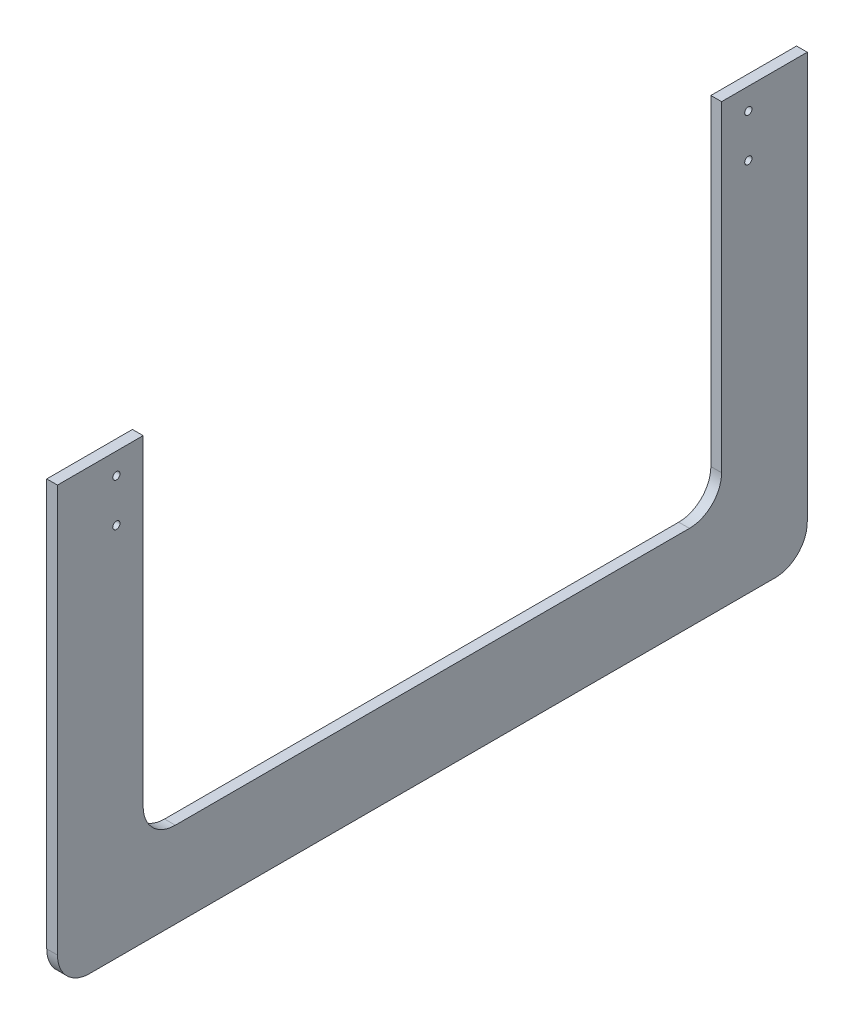
ISO-10303-21;
HEADER;
FILE_DESCRIPTION(('STEP AP214'),'2;1');
FILE_NAME('part.step','',(''),(''),'','','');
FILE_SCHEMA(('AUTOMOTIVE_DESIGN { 1 0 10303 214 1 1 1 1 }'));
ENDSEC;
DATA;
#1=APPLICATION_CONTEXT('core data for automotive mechanical design processes');
#2=APPLICATION_PROTOCOL_DEFINITION('international standard','automotive_design',2000,#1);
#3=PRODUCT_CONTEXT('',#1,'mechanical');
#4=PRODUCT('Part','Part','',(#3));
#5=PRODUCT_RELATED_PRODUCT_CATEGORY('part','',(#4));
#6=PRODUCT_DEFINITION_FORMATION('','',#4);
#7=PRODUCT_DEFINITION_CONTEXT('part definition',#1,'design');
#8=PRODUCT_DEFINITION('design','',#6,#7);
#9=PRODUCT_DEFINITION_SHAPE('','',#8);
#10=(LENGTH_UNIT() NAMED_UNIT(*) SI_UNIT(.MILLI.,.METRE.));
#11=(NAMED_UNIT(*) PLANE_ANGLE_UNIT() SI_UNIT($,.RADIAN.));
#12=(NAMED_UNIT(*) SI_UNIT($,.STERADIAN.) SOLID_ANGLE_UNIT());
#13=UNCERTAINTY_MEASURE_WITH_UNIT(LENGTH_MEASURE(1.E-05),#10,'distance_accuracy_value','');
#14=(GEOMETRIC_REPRESENTATION_CONTEXT(3) GLOBAL_UNCERTAINTY_ASSIGNED_CONTEXT((#13)) GLOBAL_UNIT_ASSIGNED_CONTEXT((#10,
#11,#12)) REPRESENTATION_CONTEXT('',''));
#15=CARTESIAN_POINT('',(0.,0.,0.));
#16=DIRECTION('',(0.,0.,1.));
#17=DIRECTION('',(1.,0.,0.));
#18=AXIS2_PLACEMENT_3D('',#15,#16,#17);
#19=CARTESIAN_POINT('',(6.35,0.,171.45));
#20=DIRECTION('',(0.,0.,1.));
#21=DIRECTION('',(0.,-1.,0.));
#22=AXIS2_PLACEMENT_3D('',#19,#20,#21);
#23=PLANE('',#22);
#24=DIRECTION('',(0.,1.,0.));
#25=VECTOR('',#24,1.);
#26=CARTESIAN_POINT('',(0.,0.,171.45));
#27=LINE('',#26,#25);
#28=CARTESIAN_POINT('',(0.,-190.5,171.45));
#29=VERTEX_POINT('',#28);
#30=CARTESIAN_POINT('',(0.,0.,171.45));
#31=VERTEX_POINT('',#30);
#32=EDGE_CURVE('E153',#29,#31,#27,.T.);
#33=ORIENTED_EDGE('',*,*,#32,.T.);
#34=DIRECTION('',(-1.,0.,0.));
#35=VECTOR('',#34,1.);
#36=CARTESIAN_POINT('',(6.35,0.,171.45));
#37=LINE('',#36,#35);
#38=CARTESIAN_POINT('',(6.35,0.,171.45));
#39=VERTEX_POINT('',#38);
#40=EDGE_CURVE('E11',#39,#31,#37,.T.);
#41=ORIENTED_EDGE('',*,*,#40,.F.);
#42=DIRECTION('',(0.,1.,0.));
#43=VECTOR('',#42,1.);
#44=CARTESIAN_POINT('',(6.35,0.,171.45));
#45=LINE('',#44,#43);
#46=CARTESIAN_POINT('',(6.35,-190.5,171.45));
#47=VERTEX_POINT('',#46);
#48=EDGE_CURVE('E176',#47,#39,#45,.T.);
#49=ORIENTED_EDGE('',*,*,#48,.F.);
#50=DIRECTION('',(-1.,0.,0.));
#51=VECTOR('',#50,1.);
#52=CARTESIAN_POINT('',(6.35,-190.5,171.45));
#53=LINE('',#52,#51);
#54=EDGE_CURVE('E149',#47,#29,#53,.T.);
#55=ORIENTED_EDGE('',*,*,#54,.T.);
#56=EDGE_LOOP('',(#33,#41,#49,#55));
#57=FACE_BOUND('',#56,.T.);
#58=ADVANCED_FACE('F33',(#57),#23,.F.);
#59=CARTESIAN_POINT('',(6.35,0.,222.25));
#60=DIRECTION('',(0.,-1.,0.));
#61=DIRECTION('',(0.,0.,-1.));
#62=AXIS2_PLACEMENT_3D('',#59,#60,#61);
#63=PLANE('',#62);
#64=DIRECTION('',(0.,0.,1.));
#65=VECTOR('',#64,1.);
#66=CARTESIAN_POINT('',(0.,0.,222.25));
#67=LINE('',#66,#65);
#68=CARTESIAN_POINT('',(0.,0.,222.25));
#69=VERTEX_POINT('',#68);
#70=EDGE_CURVE('E156',#31,#69,#67,.T.);
#71=ORIENTED_EDGE('',*,*,#70,.T.);
#72=DIRECTION('',(-1.,0.,0.));
#73=VECTOR('',#72,1.);
#74=CARTESIAN_POINT('',(6.35,0.,222.25));
#75=LINE('',#74,#73);
#76=CARTESIAN_POINT('',(6.35,0.,222.25));
#77=VERTEX_POINT('',#76);
#78=EDGE_CURVE('E41',#77,#69,#75,.T.);
#79=ORIENTED_EDGE('',*,*,#78,.F.);
#80=DIRECTION('',(0.,0.,1.));
#81=VECTOR('',#80,1.);
#82=CARTESIAN_POINT('',(6.35,0.,222.25));
#83=LINE('',#82,#81);
#84=EDGE_CURVE('E104',#39,#77,#83,.T.);
#85=ORIENTED_EDGE('',*,*,#84,.F.);
#86=ORIENTED_EDGE('',*,*,#40,.T.);
#87=EDGE_LOOP('',(#71,#79,#85,#86));
#88=FACE_BOUND('',#87,.T.);
#89=ADVANCED_FACE('F255',(#88),#63,.F.);
#90=CARTESIAN_POINT('',(6.35,0.,222.25));
#91=DIRECTION('',(0.,0.,-1.));
#92=DIRECTION('',(0.,1.,0.));
#93=AXIS2_PLACEMENT_3D('',#90,#91,#92);
#94=PLANE('',#93);
#95=DIRECTION('',(0.,-1.,0.));
#96=VECTOR('',#95,1.);
#97=CARTESIAN_POINT('',(0.,0.,222.25));
#98=LINE('',#97,#96);
#99=CARTESIAN_POINT('',(0.,-241.3,222.25));
#100=VERTEX_POINT('',#99);
#101=EDGE_CURVE('E159',#69,#100,#98,.T.);
#102=ORIENTED_EDGE('',*,*,#101,.T.);
#103=DIRECTION('',(-1.,0.,0.));
#104=VECTOR('',#103,1.);
#105=CARTESIAN_POINT('',(6.35,-241.3,222.25));
#106=LINE('',#105,#104);
#107=CARTESIAN_POINT('',(6.35,-241.3,222.25));
#108=VERTEX_POINT('',#107);
#109=EDGE_CURVE('E195',#108,#100,#106,.T.);
#110=ORIENTED_EDGE('',*,*,#109,.F.);
#111=DIRECTION('',(0.,-1.,0.));
#112=VECTOR('',#111,1.);
#113=CARTESIAN_POINT('',(6.35,0.,222.25));
#114=LINE('',#113,#112);
#115=EDGE_CURVE('E203',#77,#108,#114,.T.);
#116=ORIENTED_EDGE('',*,*,#115,.F.);
#117=ORIENTED_EDGE('',*,*,#78,.T.);
#118=EDGE_LOOP('',(#102,#110,#116,#117));
#119=FACE_BOUND('',#118,.T.);
#120=ADVANCED_FACE('F201',(#119),#94,.F.);
#121=CARTESIAN_POINT('',(6.35,-241.3,203.2));
#122=DIRECTION('',(-1.,0.,0.));
#123=DIRECTION('',(0.,0.,1.));
#124=AXIS2_PLACEMENT_3D('',#121,#122,#123);
#125=CYLINDRICAL_SURFACE('',#124,19.05);
#126=CARTESIAN_POINT('',(0.,-241.3,203.2));
#127=DIRECTION('',(1.,0.,0.));
#128=DIRECTION('',(0.,0.,1.));
#129=AXIS2_PLACEMENT_3D('',#126,#127,#128);
#130=CIRCLE('',#129,19.05);
#131=CARTESIAN_POINT('',(0.,-260.35,203.2));
#132=VERTEX_POINT('',#131);
#133=EDGE_CURVE('E161',#100,#132,#130,.T.);
#134=ORIENTED_EDGE('',*,*,#133,.T.);
#135=DIRECTION('',(-1.,0.,0.));
#136=VECTOR('',#135,1.);
#137=CARTESIAN_POINT('',(6.35,-260.35,203.2));
#138=LINE('',#137,#136);
#139=CARTESIAN_POINT('',(6.35,-260.35,203.2));
#140=VERTEX_POINT('',#139);
#141=EDGE_CURVE('E192',#140,#132,#138,.T.);
#142=ORIENTED_EDGE('',*,*,#141,.F.);
#143=CARTESIAN_POINT('',(6.35,-241.3,203.2));
#144=DIRECTION('',(1.,0.,0.));
#145=DIRECTION('',(0.,0.,1.));
#146=AXIS2_PLACEMENT_3D('',#143,#144,#145);
#147=CIRCLE('',#146,19.05);
#148=EDGE_CURVE('E221',#108,#140,#147,.T.);
#149=ORIENTED_EDGE('',*,*,#148,.F.);
#150=ORIENTED_EDGE('',*,*,#109,.T.);
#151=EDGE_LOOP('',(#134,#142,#149,#150));
#152=FACE_BOUND('',#151,.T.);
#153=ADVANCED_FACE('F212',(#152),#125,.T.);
#154=CARTESIAN_POINT('',(6.35,-260.35,203.2));
#155=DIRECTION('',(0.,1.,0.));
#156=DIRECTION('',(0.,0.,1.));
#157=AXIS2_PLACEMENT_3D('',#154,#155,#156);
#158=PLANE('',#157);
#159=DIRECTION('',(0.,0.,-1.));
#160=VECTOR('',#159,1.);
#161=CARTESIAN_POINT('',(0.,-260.35,203.2));
#162=LINE('',#161,#160);
#163=CARTESIAN_POINT('',(0.,-260.35,-203.2));
#164=VERTEX_POINT('',#163);
#165=EDGE_CURVE('E163',#132,#164,#162,.T.);
#166=ORIENTED_EDGE('',*,*,#165,.T.);
#167=DIRECTION('',(-1.,0.,0.));
#168=VECTOR('',#167,1.);
#169=CARTESIAN_POINT('',(6.35,-260.35,-203.2));
#170=LINE('',#169,#168);
#171=CARTESIAN_POINT('',(6.35,-260.35,-203.2));
#172=VERTEX_POINT('',#171);
#173=EDGE_CURVE('E189',#172,#164,#170,.T.);
#174=ORIENTED_EDGE('',*,*,#173,.F.);
#175=DIRECTION('',(0.,0.,-1.));
#176=VECTOR('',#175,1.);
#177=CARTESIAN_POINT('',(6.35,-260.35,203.2));
#178=LINE('',#177,#176);
#179=EDGE_CURVE('E218',#140,#172,#178,.T.);
#180=ORIENTED_EDGE('',*,*,#179,.F.);
#181=ORIENTED_EDGE('',*,*,#141,.T.);
#182=EDGE_LOOP('',(#166,#174,#180,#181));
#183=FACE_BOUND('',#182,.T.);
#184=ADVANCED_FACE('F216',(#183),#158,.F.);
#185=CARTESIAN_POINT('',(6.35,-241.3,-203.2));
#186=DIRECTION('',(-1.,0.,0.));
#187=DIRECTION('',(0.,0.,1.));
#188=AXIS2_PLACEMENT_3D('',#185,#186,#187);
#189=CYLINDRICAL_SURFACE('',#188,19.05);
#190=CARTESIAN_POINT('',(0.,-241.3,-203.2));
#191=DIRECTION('',(1.,0.,0.));
#192=DIRECTION('',(0.,0.,-1.));
#193=AXIS2_PLACEMENT_3D('',#190,#191,#192);
#194=CIRCLE('',#193,19.05);
#195=CARTESIAN_POINT('',(0.,-241.3,-222.25));
#196=VERTEX_POINT('',#195);
#197=EDGE_CURVE('E165',#164,#196,#194,.T.);
#198=ORIENTED_EDGE('',*,*,#197,.T.);
#199=DIRECTION('',(-1.,0.,0.));
#200=VECTOR('',#199,1.);
#201=CARTESIAN_POINT('',(6.35,-241.3,-222.25));
#202=LINE('',#201,#200);
#203=CARTESIAN_POINT('',(6.35,-241.3,-222.25));
#204=VERTEX_POINT('',#203);
#205=EDGE_CURVE('E186',#204,#196,#202,.T.);
#206=ORIENTED_EDGE('',*,*,#205,.F.);
#207=CARTESIAN_POINT('',(6.35,-241.3,-203.2));
#208=DIRECTION('',(1.,0.,0.));
#209=DIRECTION('',(0.,0.,-1.));
#210=AXIS2_PLACEMENT_3D('',#207,#208,#209);
#211=CIRCLE('',#210,19.05);
#212=EDGE_CURVE('E220',#172,#204,#211,.T.);
#213=ORIENTED_EDGE('',*,*,#212,.F.);
#214=ORIENTED_EDGE('',*,*,#173,.T.);
#215=EDGE_LOOP('',(#198,#206,#213,#214));
#216=FACE_BOUND('',#215,.T.);
#217=ADVANCED_FACE('F268',(#216),#189,.T.);
#218=CARTESIAN_POINT('',(6.35,0.,-222.25));
#219=DIRECTION('',(0.,0.,1.));
#220=DIRECTION('',(0.,-1.,0.));
#221=AXIS2_PLACEMENT_3D('',#218,#219,#220);
#222=PLANE('',#221);
#223=DIRECTION('',(0.,1.,0.));
#224=VECTOR('',#223,1.);
#225=CARTESIAN_POINT('',(0.,0.,-222.25));
#226=LINE('',#225,#224);
#227=CARTESIAN_POINT('',(0.,0.,-222.25));
#228=VERTEX_POINT('',#227);
#229=EDGE_CURVE('E167',#196,#228,#226,.T.);
#230=ORIENTED_EDGE('',*,*,#229,.T.);
#231=DIRECTION('',(-1.,0.,0.));
#232=VECTOR('',#231,1.);
#233=CARTESIAN_POINT('',(6.35,0.,-222.25));
#234=LINE('',#233,#232);
#235=CARTESIAN_POINT('',(6.35,0.,-222.25));
#236=VERTEX_POINT('',#235);
#237=EDGE_CURVE('E183',#236,#228,#234,.T.);
#238=ORIENTED_EDGE('',*,*,#237,.F.);
#239=DIRECTION('',(0.,1.,0.));
#240=VECTOR('',#239,1.);
#241=CARTESIAN_POINT('',(6.35,0.,-222.25));
#242=LINE('',#241,#240);
#243=EDGE_CURVE('E223',#204,#236,#242,.T.);
#244=ORIENTED_EDGE('',*,*,#243,.F.);
#245=ORIENTED_EDGE('',*,*,#205,.T.);
#246=EDGE_LOOP('',(#230,#238,#244,#245));
#247=FACE_BOUND('',#246,.T.);
#248=ADVANCED_FACE('F271',(#247),#222,.F.);
#249=CARTESIAN_POINT('',(6.35,0.,-171.45));
#250=DIRECTION('',(0.,-1.,0.));
#251=DIRECTION('',(0.,0.,-1.));
#252=AXIS2_PLACEMENT_3D('',#249,#250,#251);
#253=PLANE('',#252);
#254=DIRECTION('',(0.,0.,1.));
#255=VECTOR('',#254,1.);
#256=CARTESIAN_POINT('',(0.,0.,-171.45));
#257=LINE('',#256,#255);
#258=CARTESIAN_POINT('',(0.,0.,-171.45));
#259=VERTEX_POINT('',#258);
#260=EDGE_CURVE('E169',#228,#259,#257,.T.);
#261=ORIENTED_EDGE('',*,*,#260,.T.);
#262=DIRECTION('',(-1.,0.,0.));
#263=VECTOR('',#262,1.);
#264=CARTESIAN_POINT('',(6.35,0.,-171.45));
#265=LINE('',#264,#263);
#266=CARTESIAN_POINT('',(6.35,0.,-171.45));
#267=VERTEX_POINT('',#266);
#268=EDGE_CURVE('E180',#267,#259,#265,.T.);
#269=ORIENTED_EDGE('',*,*,#268,.F.);
#270=DIRECTION('',(0.,0.,1.));
#271=VECTOR('',#270,1.);
#272=CARTESIAN_POINT('',(6.35,0.,-171.45));
#273=LINE('',#272,#271);
#274=EDGE_CURVE('E229',#236,#267,#273,.T.);
#275=ORIENTED_EDGE('',*,*,#274,.F.);
#276=ORIENTED_EDGE('',*,*,#237,.T.);
#277=EDGE_LOOP('',(#261,#269,#275,#276));
#278=FACE_BOUND('',#277,.T.);
#279=ADVANCED_FACE('F235',(#278),#253,.F.);
#280=CARTESIAN_POINT('',(6.35,0.,-171.45));
#281=DIRECTION('',(0.,0.,-1.));
#282=DIRECTION('',(0.,1.,0.));
#283=AXIS2_PLACEMENT_3D('',#280,#281,#282);
#284=PLANE('',#283);
#285=DIRECTION('',(0.,-1.,0.));
#286=VECTOR('',#285,1.);
#287=CARTESIAN_POINT('',(0.,0.,-171.45));
#288=LINE('',#287,#286);
#289=CARTESIAN_POINT('',(0.,-190.5,-171.45));
#290=VERTEX_POINT('',#289);
#291=EDGE_CURVE('E171',#259,#290,#288,.T.);
#292=ORIENTED_EDGE('',*,*,#291,.T.);
#293=DIRECTION('',(-1.,0.,0.));
#294=VECTOR('',#293,1.);
#295=CARTESIAN_POINT('',(6.35,-190.5,-171.45));
#296=LINE('',#295,#294);
#297=CARTESIAN_POINT('',(6.35,-190.5,-171.45));
#298=VERTEX_POINT('',#297);
#299=EDGE_CURVE('E144',#298,#290,#296,.T.);
#300=ORIENTED_EDGE('',*,*,#299,.F.);
#301=DIRECTION('',(0.,-1.,0.));
#302=VECTOR('',#301,1.);
#303=CARTESIAN_POINT('',(6.35,0.,-171.45));
#304=LINE('',#303,#302);
#305=EDGE_CURVE('E135',#267,#298,#304,.T.);
#306=ORIENTED_EDGE('',*,*,#305,.F.);
#307=ORIENTED_EDGE('',*,*,#268,.T.);
#308=EDGE_LOOP('',(#292,#300,#306,#307));
#309=FACE_BOUND('',#308,.T.);
#310=ADVANCED_FACE('F239',(#309),#284,.F.);
#311=CARTESIAN_POINT('',(6.35,-190.5,-152.4));
#312=DIRECTION('',(-1.,0.,0.));
#313=DIRECTION('',(0.,0.,1.));
#314=AXIS2_PLACEMENT_3D('',#311,#312,#313);
#315=CYLINDRICAL_SURFACE('',#314,19.05);
#316=CARTESIAN_POINT('',(0.,-190.5,-152.4));
#317=DIRECTION('',(-1.,0.,0.));
#318=DIRECTION('',(0.,0.,1.));
#319=AXIS2_PLACEMENT_3D('',#316,#317,#318);
#320=CIRCLE('',#319,19.05);
#321=CARTESIAN_POINT('',(0.,-209.55,-152.4));
#322=VERTEX_POINT('',#321);
#323=EDGE_CURVE('E143',#290,#322,#320,.T.);
#324=ORIENTED_EDGE('',*,*,#323,.T.);
#325=DIRECTION('',(-1.,0.,0.));
#326=VECTOR('',#325,1.);
#327=CARTESIAN_POINT('',(6.35,-209.55,-152.4));
#328=LINE('',#327,#326);
#329=CARTESIAN_POINT('',(6.35,-209.55,-152.4));
#330=VERTEX_POINT('',#329);
#331=EDGE_CURVE('E140',#330,#322,#328,.T.);
#332=ORIENTED_EDGE('',*,*,#331,.F.);
#333=CARTESIAN_POINT('',(6.35,-190.5,-152.4));
#334=DIRECTION('',(-1.,0.,0.));
#335=DIRECTION('',(0.,0.,1.));
#336=AXIS2_PLACEMENT_3D('',#333,#334,#335);
#337=CIRCLE('',#336,19.05);
#338=EDGE_CURVE('E129',#298,#330,#337,.T.);
#339=ORIENTED_EDGE('',*,*,#338,.F.);
#340=ORIENTED_EDGE('',*,*,#299,.T.);
#341=EDGE_LOOP('',(#324,#332,#339,#340));
#342=FACE_BOUND('',#341,.T.);
#343=ADVANCED_FACE('F141',(#342),#315,.F.);
#344=CARTESIAN_POINT('',(6.35,-209.55,152.4));
#345=DIRECTION('',(0.,-1.,0.));
#346=DIRECTION('',(0.,0.,-1.));
#347=AXIS2_PLACEMENT_3D('',#344,#345,#346);
#348=PLANE('',#347);
#349=DIRECTION('',(0.,0.,1.));
#350=VECTOR('',#349,1.);
#351=CARTESIAN_POINT('',(0.,-209.55,152.4));
#352=LINE('',#351,#350);
#353=CARTESIAN_POINT('',(0.,-209.55,152.4));
#354=VERTEX_POINT('',#353);
#355=EDGE_CURVE('E90',#322,#354,#352,.T.);
#356=ORIENTED_EDGE('',*,*,#355,.T.);
#357=DIRECTION('',(-1.,0.,0.));
#358=VECTOR('',#357,1.);
#359=CARTESIAN_POINT('',(6.35,-209.55,152.4));
#360=LINE('',#359,#358);
#361=CARTESIAN_POINT('',(6.35,-209.55,152.4));
#362=VERTEX_POINT('',#361);
#363=EDGE_CURVE('E145',#362,#354,#360,.T.);
#364=ORIENTED_EDGE('',*,*,#363,.F.);
#365=DIRECTION('',(0.,0.,1.));
#366=VECTOR('',#365,1.);
#367=CARTESIAN_POINT('',(6.35,-209.55,152.4));
#368=LINE('',#367,#366);
#369=EDGE_CURVE('E133',#330,#362,#368,.T.);
#370=ORIENTED_EDGE('',*,*,#369,.F.);
#371=ORIENTED_EDGE('',*,*,#331,.T.);
#372=EDGE_LOOP('',(#356,#364,#370,#371));
#373=FACE_BOUND('',#372,.T.);
#374=ADVANCED_FACE('F147',(#373),#348,.F.);
#375=CARTESIAN_POINT('',(6.35,-190.5,152.4));
#376=DIRECTION('',(-1.,0.,0.));
#377=DIRECTION('',(0.,0.,1.));
#378=AXIS2_PLACEMENT_3D('',#375,#376,#377);
#379=CYLINDRICAL_SURFACE('',#378,19.05);
#380=CARTESIAN_POINT('',(0.,-190.5,152.4));
#381=DIRECTION('',(-1.,0.,0.));
#382=DIRECTION('',(0.,0.,1.));
#383=AXIS2_PLACEMENT_3D('',#380,#381,#382);
#384=CIRCLE('',#383,19.05);
#385=EDGE_CURVE('E96',#354,#29,#384,.T.);
#386=ORIENTED_EDGE('',*,*,#385,.T.);
#387=ORIENTED_EDGE('',*,*,#54,.F.);
#388=CARTESIAN_POINT('',(6.35,-190.5,152.4));
#389=DIRECTION('',(-1.,0.,0.));
#390=DIRECTION('',(0.,0.,1.));
#391=AXIS2_PLACEMENT_3D('',#388,#389,#390);
#392=CIRCLE('',#391,19.05);
#393=EDGE_CURVE('E49',#362,#47,#392,.T.);
#394=ORIENTED_EDGE('',*,*,#393,.F.);
#395=ORIENTED_EDGE('',*,*,#363,.T.);
#396=EDGE_LOOP('',(#386,#387,#394,#395));
#397=FACE_BOUND('',#396,.T.);
#398=ADVANCED_FACE('F243',(#397),#379,.F.);
#399=CARTESIAN_POINT('',(6.35,-190.5,152.4));
#400=DIRECTION('',(-1.,0.,0.));
#401=DIRECTION('',(0.,0.,1.));
#402=AXIS2_PLACEMENT_3D('',#399,#400,#401);
#403=PLANE('',#402);
#404=CARTESIAN_POINT('',(6.35,-12.7,187.325));
#405=DIRECTION('',(-1.,0.,0.));
#406=DIRECTION('',(0.,0.,1.));
#407=AXIS2_PLACEMENT_3D('',#404,#405,#406);
#408=CIRCLE('',#407,2.15265);
#409=CARTESIAN_POINT('',(6.35,-12.7,189.47765));
#410=VERTEX_POINT('',#409);
#411=EDGE_CURVE('E399',#410,#410,#408,.T.);
#412=ORIENTED_EDGE('',*,*,#411,.T.);
#413=EDGE_LOOP('',(#412));
#414=FACE_BOUND('',#413,.T.);
#415=CARTESIAN_POINT('',(6.35,-38.1,187.325));
#416=DIRECTION('',(-1.,0.,0.));
#417=DIRECTION('',(0.,0.,1.));
#418=AXIS2_PLACEMENT_3D('',#415,#416,#417);
#419=CIRCLE('',#418,2.15265);
#420=CARTESIAN_POINT('',(6.35,-38.1,189.47765));
#421=VERTEX_POINT('',#420);
#422=EDGE_CURVE('E410',#421,#421,#419,.T.);
#423=ORIENTED_EDGE('',*,*,#422,.T.);
#424=EDGE_LOOP('',(#423));
#425=FACE_BOUND('',#424,.T.);
#426=CARTESIAN_POINT('',(6.35,-12.7,-187.325));
#427=DIRECTION('',(-1.,0.,0.));
#428=DIRECTION('',(0.,0.,1.));
#429=AXIS2_PLACEMENT_3D('',#426,#427,#428);
#430=CIRCLE('',#429,2.15265);
#431=CARTESIAN_POINT('',(6.35,-12.7,-185.17235));
#432=VERTEX_POINT('',#431);
#433=EDGE_CURVE('E419',#432,#432,#430,.T.);
#434=ORIENTED_EDGE('',*,*,#433,.T.);
#435=EDGE_LOOP('',(#434));
#436=FACE_BOUND('',#435,.T.);
#437=CARTESIAN_POINT('',(6.35,-38.1,-187.325));
#438=DIRECTION('',(-1.,0.,0.));
#439=DIRECTION('',(0.,0.,1.));
#440=AXIS2_PLACEMENT_3D('',#437,#438,#439);
#441=CIRCLE('',#440,2.15265);
#442=CARTESIAN_POINT('',(6.35,-38.1,-185.17235));
#443=VERTEX_POINT('',#442);
#444=EDGE_CURVE('E157',#443,#443,#441,.T.);
#445=ORIENTED_EDGE('',*,*,#444,.T.);
#446=EDGE_LOOP('',(#445));
#447=FACE_BOUND('',#446,.T.);
#448=ORIENTED_EDGE('',*,*,#48,.T.);
#449=ORIENTED_EDGE('',*,*,#84,.T.);
#450=ORIENTED_EDGE('',*,*,#115,.T.);
#451=ORIENTED_EDGE('',*,*,#148,.T.);
#452=ORIENTED_EDGE('',*,*,#179,.T.);
#453=ORIENTED_EDGE('',*,*,#212,.T.);
#454=ORIENTED_EDGE('',*,*,#243,.T.);
#455=ORIENTED_EDGE('',*,*,#274,.T.);
#456=ORIENTED_EDGE('',*,*,#305,.T.);
#457=ORIENTED_EDGE('',*,*,#338,.T.);
#458=ORIENTED_EDGE('',*,*,#369,.T.);
#459=ORIENTED_EDGE('',*,*,#393,.T.);
#460=EDGE_LOOP('',(#448,#449,#450,#451,#452,#453,#454,#455,#456,#457,#458,#459));
#461=FACE_BOUND('',#460,.T.);
#462=ADVANCED_FACE('F131',(#414,#425,#436,#447,#461),#403,.F.);
#463=CARTESIAN_POINT('',(0.,-190.5,152.4));
#464=DIRECTION('',(-1.,0.,0.));
#465=DIRECTION('',(0.,0.,1.));
#466=AXIS2_PLACEMENT_3D('',#463,#464,#465);
#467=PLANE('',#466);
#468=CARTESIAN_POINT('',(0.,-12.7,187.325));
#469=DIRECTION('',(-1.,0.,0.));
#470=DIRECTION('',(0.,0.,1.));
#471=AXIS2_PLACEMENT_3D('',#468,#469,#470);
#472=CIRCLE('',#471,4.5593);
#473=CARTESIAN_POINT('',(0.,-12.7,191.8843));
#474=VERTEX_POINT('',#473);
#475=EDGE_CURVE('E397',#474,#474,#472,.T.);
#476=ORIENTED_EDGE('',*,*,#475,.F.);
#477=EDGE_LOOP('',(#476));
#478=FACE_BOUND('',#477,.T.);
#479=CARTESIAN_POINT('',(0.,-38.1,187.325));
#480=DIRECTION('',(-1.,0.,0.));
#481=DIRECTION('',(0.,0.,1.));
#482=AXIS2_PLACEMENT_3D('',#479,#480,#481);
#483=CIRCLE('',#482,4.5593);
#484=CARTESIAN_POINT('',(0.,-38.1,191.8843));
#485=VERTEX_POINT('',#484);
#486=EDGE_CURVE('E404',#485,#485,#483,.T.);
#487=ORIENTED_EDGE('',*,*,#486,.F.);
#488=EDGE_LOOP('',(#487));
#489=FACE_BOUND('',#488,.T.);
#490=CARTESIAN_POINT('',(0.,-12.7,-187.325));
#491=DIRECTION('',(-1.,0.,0.));
#492=DIRECTION('',(0.,0.,1.));
#493=AXIS2_PLACEMENT_3D('',#490,#491,#492);
#494=CIRCLE('',#493,4.5593);
#495=CARTESIAN_POINT('',(0.,-12.7,-182.7657));
#496=VERTEX_POINT('',#495);
#497=EDGE_CURVE('E413',#496,#496,#494,.T.);
#498=ORIENTED_EDGE('',*,*,#497,.F.);
#499=EDGE_LOOP('',(#498));
#500=FACE_BOUND('',#499,.T.);
#501=CARTESIAN_POINT('',(0.,-38.1,-187.325));
#502=DIRECTION('',(-1.,0.,0.));
#503=DIRECTION('',(0.,0.,1.));
#504=AXIS2_PLACEMENT_3D('',#501,#502,#503);
#505=CIRCLE('',#504,4.5593);
#506=CARTESIAN_POINT('',(0.,-38.1,-182.7657));
#507=VERTEX_POINT('',#506);
#508=EDGE_CURVE('E422',#507,#507,#505,.T.);
#509=ORIENTED_EDGE('',*,*,#508,.F.);
#510=EDGE_LOOP('',(#509));
#511=FACE_BOUND('',#510,.T.);
#512=ORIENTED_EDGE('',*,*,#32,.F.);
#513=ORIENTED_EDGE('',*,*,#385,.F.);
#514=ORIENTED_EDGE('',*,*,#355,.F.);
#515=ORIENTED_EDGE('',*,*,#323,.F.);
#516=ORIENTED_EDGE('',*,*,#291,.F.);
#517=ORIENTED_EDGE('',*,*,#260,.F.);
#518=ORIENTED_EDGE('',*,*,#229,.F.);
#519=ORIENTED_EDGE('',*,*,#197,.F.);
#520=ORIENTED_EDGE('',*,*,#165,.F.);
#521=ORIENTED_EDGE('',*,*,#133,.F.);
#522=ORIENTED_EDGE('',*,*,#101,.F.);
#523=ORIENTED_EDGE('',*,*,#70,.F.);
#524=EDGE_LOOP('',(#512,#513,#514,#515,#516,#517,#518,#519,#520,#521,#522,#523));
#525=FACE_BOUND('',#524,.T.);
#526=ADVANCED_FACE('F207',(#478,#489,#500,#511,#525),#467,.T.);
#527=CARTESIAN_POINT('',(0.,-38.1,-187.325));
#528=DIRECTION('',(-1.,0.,0.));
#529=DIRECTION('',(0.,0.,1.));
#530=AXIS2_PLACEMENT_3D('',#527,#528,#529);
#531=CYLINDRICAL_SURFACE('',#530,2.15265);
#532=ORIENTED_EDGE('',*,*,#444,.F.);
#533=EDGE_LOOP('',(#532));
#534=FACE_BOUND('',#533,.T.);
#535=CARTESIAN_POINT('',(2.76853412723844,-38.1,-187.325));
#536=DIRECTION('',(-1.,0.,0.));
#537=DIRECTION('',(0.,0.,1.));
#538=AXIS2_PLACEMENT_3D('',#535,#536,#537);
#539=CIRCLE('',#538,2.15265);
#540=CARTESIAN_POINT('',(2.76853412723844,-38.1,-185.17235));
#541=VERTEX_POINT('',#540);
#542=EDGE_CURVE('E425',#541,#541,#539,.T.);
#543=ORIENTED_EDGE('',*,*,#542,.T.);
#544=EDGE_LOOP('',(#543));
#545=FACE_BOUND('',#544,.T.);
#546=ADVANCED_FACE('F299',(#534,#545),#531,.F.);
#547=CARTESIAN_POINT('',(0.,-38.1,-187.325));
#548=DIRECTION('',(-1.,0.,0.));
#549=DIRECTION('',(0.,0.,1.));
#550=AXIS2_PLACEMENT_3D('',#547,#548,#549);
#551=CONICAL_SURFACE('',#550,4.5593,0.715584993317676);
#552=ORIENTED_EDGE('',*,*,#542,.F.);
#553=EDGE_LOOP('',(#552));
#554=FACE_BOUND('',#553,.T.);
#555=ORIENTED_EDGE('',*,*,#508,.T.);
#556=EDGE_LOOP('',(#555));
#557=FACE_BOUND('',#556,.T.);
#558=ADVANCED_FACE('F304',(#554,#557),#551,.F.);
#559=CARTESIAN_POINT('',(0.,-12.7,-187.325));
#560=DIRECTION('',(-1.,0.,0.));
#561=DIRECTION('',(0.,0.,1.));
#562=AXIS2_PLACEMENT_3D('',#559,#560,#561);
#563=CYLINDRICAL_SURFACE('',#562,2.15265);
#564=ORIENTED_EDGE('',*,*,#433,.F.);
#565=EDGE_LOOP('',(#564));
#566=FACE_BOUND('',#565,.T.);
#567=CARTESIAN_POINT('',(2.76853412723844,-12.7,-187.325));
#568=DIRECTION('',(-1.,0.,0.));
#569=DIRECTION('',(0.,0.,1.));
#570=AXIS2_PLACEMENT_3D('',#567,#568,#569);
#571=CIRCLE('',#570,2.15265);
#572=CARTESIAN_POINT('',(2.76853412723844,-12.7,-185.17235));
#573=VERTEX_POINT('',#572);
#574=EDGE_CURVE('E416',#573,#573,#571,.T.);
#575=ORIENTED_EDGE('',*,*,#574,.T.);
#576=EDGE_LOOP('',(#575));
#577=FACE_BOUND('',#576,.T.);
#578=ADVANCED_FACE('F316',(#566,#577),#563,.F.);
#579=CARTESIAN_POINT('',(0.,-12.7,-187.325));
#580=DIRECTION('',(-1.,0.,0.));
#581=DIRECTION('',(0.,0.,1.));
#582=AXIS2_PLACEMENT_3D('',#579,#580,#581);
#583=CONICAL_SURFACE('',#582,4.5593,0.715584993317675);
#584=ORIENTED_EDGE('',*,*,#574,.F.);
#585=EDGE_LOOP('',(#584));
#586=FACE_BOUND('',#585,.T.);
#587=ORIENTED_EDGE('',*,*,#497,.T.);
#588=EDGE_LOOP('',(#587));
#589=FACE_BOUND('',#588,.T.);
#590=ADVANCED_FACE('F326',(#586,#589),#583,.F.);
#591=CARTESIAN_POINT('',(0.,-38.1,187.325));
#592=DIRECTION('',(-1.,0.,0.));
#593=DIRECTION('',(0.,0.,1.));
#594=AXIS2_PLACEMENT_3D('',#591,#592,#593);
#595=CYLINDRICAL_SURFACE('',#594,2.15265);
#596=ORIENTED_EDGE('',*,*,#422,.F.);
#597=EDGE_LOOP('',(#596));
#598=FACE_BOUND('',#597,.T.);
#599=CARTESIAN_POINT('',(2.76853412723844,-38.1,187.325));
#600=DIRECTION('',(-1.,0.,0.));
#601=DIRECTION('',(0.,0.,1.));
#602=AXIS2_PLACEMENT_3D('',#599,#600,#601);
#603=CIRCLE('',#602,2.15265);
#604=CARTESIAN_POINT('',(2.76853412723844,-38.1,189.47765));
#605=VERTEX_POINT('',#604);
#606=EDGE_CURVE('E407',#605,#605,#603,.T.);
#607=ORIENTED_EDGE('',*,*,#606,.T.);
#608=EDGE_LOOP('',(#607));
#609=FACE_BOUND('',#608,.T.);
#610=ADVANCED_FACE('F336',(#598,#609),#595,.F.);
#611=CARTESIAN_POINT('',(0.,-38.1,187.325));
#612=DIRECTION('',(-1.,0.,0.));
#613=DIRECTION('',(0.,0.,1.));
#614=AXIS2_PLACEMENT_3D('',#611,#612,#613);
#615=CONICAL_SURFACE('',#614,4.5593,0.715584993317676);
#616=ORIENTED_EDGE('',*,*,#606,.F.);
#617=EDGE_LOOP('',(#616));
#618=FACE_BOUND('',#617,.T.);
#619=ORIENTED_EDGE('',*,*,#486,.T.);
#620=EDGE_LOOP('',(#619));
#621=FACE_BOUND('',#620,.T.);
#622=ADVANCED_FACE('F357',(#618,#621),#615,.F.);
#623=CARTESIAN_POINT('',(0.,-12.7,187.325));
#624=DIRECTION('',(-1.,0.,0.));
#625=DIRECTION('',(0.,0.,1.));
#626=AXIS2_PLACEMENT_3D('',#623,#624,#625);
#627=CYLINDRICAL_SURFACE('',#626,2.15265);
#628=ORIENTED_EDGE('',*,*,#411,.F.);
#629=EDGE_LOOP('',(#628));
#630=FACE_BOUND('',#629,.T.);
#631=CARTESIAN_POINT('',(2.76853412723844,-12.7,187.325));
#632=DIRECTION('',(-1.,0.,0.));
#633=DIRECTION('',(0.,0.,1.));
#634=AXIS2_PLACEMENT_3D('',#631,#632,#633);
#635=CIRCLE('',#634,2.15265);
#636=CARTESIAN_POINT('',(2.76853412723844,-12.7,189.47765));
#637=VERTEX_POINT('',#636);
#638=EDGE_CURVE('E394',#637,#637,#635,.T.);
#639=ORIENTED_EDGE('',*,*,#638,.T.);
#640=EDGE_LOOP('',(#639));
#641=FACE_BOUND('',#640,.T.);
#642=ADVANCED_FACE('F367',(#630,#641),#627,.F.);
#643=CARTESIAN_POINT('',(0.,-12.7,187.325));
#644=DIRECTION('',(-1.,0.,0.));
#645=DIRECTION('',(0.,0.,1.));
#646=AXIS2_PLACEMENT_3D('',#643,#644,#645);
#647=CONICAL_SURFACE('',#646,4.5593,0.715584993317675);
#648=ORIENTED_EDGE('',*,*,#638,.F.);
#649=EDGE_LOOP('',(#648));
#650=FACE_BOUND('',#649,.T.);
#651=ORIENTED_EDGE('',*,*,#475,.T.);
#652=EDGE_LOOP('',(#651));
#653=FACE_BOUND('',#652,.T.);
#654=ADVANCED_FACE('F377',(#650,#653),#647,.F.);
#655=CLOSED_SHELL('',(#58,#89,#120,#153,#184,#217,#248,#279,#310,#343,#374,#398,#462,#526,#546,
#558,#578,#590,#610,#622,#642,#654));
#656=MANIFOLD_SOLID_BREP('B2',#655);
#657=ADVANCED_BREP_SHAPE_REPRESENTATION('',(#18,#656),#14);
#658=SHAPE_DEFINITION_REPRESENTATION(#9,#657);
ENDSEC;
END-ISO-10303-21;
